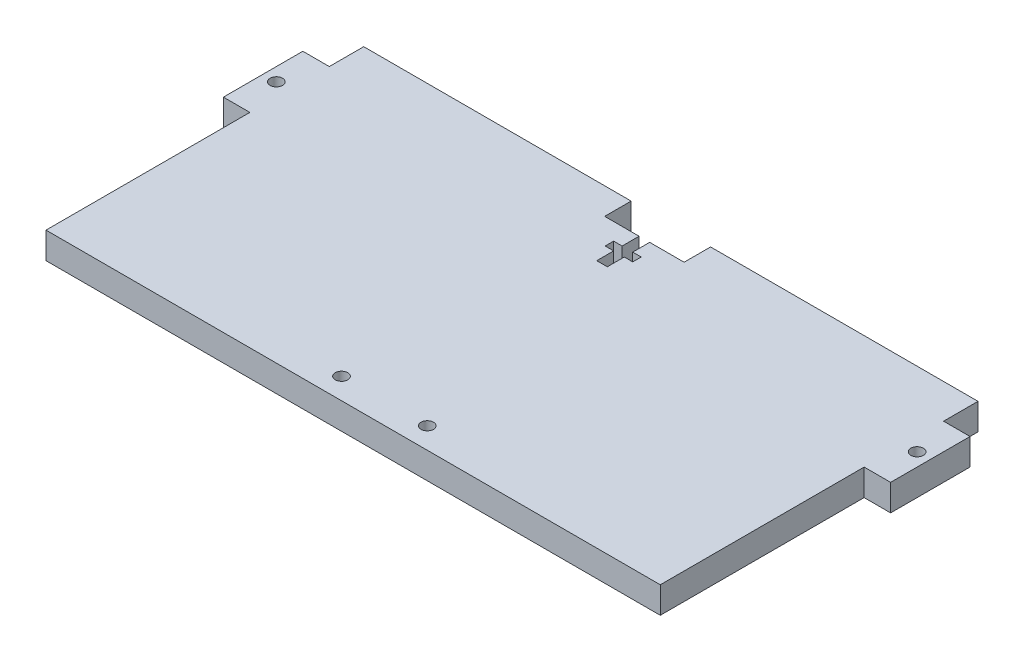
ISO-10303-21;
HEADER;
FILE_DESCRIPTION(('STEP AP214'),'2;1');
FILE_NAME('part.step','',(''),(''),'','','');
FILE_SCHEMA(('AUTOMOTIVE_DESIGN { 1 0 10303 214 1 1 1 1 }'));
ENDSEC;
DATA;
#1=APPLICATION_CONTEXT('core data for automotive mechanical design processes');
#2=APPLICATION_PROTOCOL_DEFINITION('international standard','automotive_design',2000,#1);
#3=PRODUCT_CONTEXT('',#1,'mechanical');
#4=PRODUCT('Part','Part','',(#3));
#5=PRODUCT_RELATED_PRODUCT_CATEGORY('part','',(#4));
#6=PRODUCT_DEFINITION_FORMATION('','',#4);
#7=PRODUCT_DEFINITION_CONTEXT('part definition',#1,'design');
#8=PRODUCT_DEFINITION('design','',#6,#7);
#9=PRODUCT_DEFINITION_SHAPE('','',#8);
#10=(LENGTH_UNIT() NAMED_UNIT(*) SI_UNIT(.MILLI.,.METRE.));
#11=(NAMED_UNIT(*) PLANE_ANGLE_UNIT() SI_UNIT($,.RADIAN.));
#12=(NAMED_UNIT(*) SI_UNIT($,.STERADIAN.) SOLID_ANGLE_UNIT());
#13=UNCERTAINTY_MEASURE_WITH_UNIT(LENGTH_MEASURE(1.E-05),#10,'distance_accuracy_value','');
#14=(GEOMETRIC_REPRESENTATION_CONTEXT(3) GLOBAL_UNCERTAINTY_ASSIGNED_CONTEXT((#13)) GLOBAL_UNIT_ASSIGNED_CONTEXT((#10,
#11,#12)) REPRESENTATION_CONTEXT('',''));
#15=CARTESIAN_POINT('',(0.,0.,0.));
#16=DIRECTION('',(0.,0.,1.));
#17=DIRECTION('',(1.,0.,0.));
#18=AXIS2_PLACEMENT_3D('',#15,#16,#17);
#19=CARTESIAN_POINT('',(-9.52499999999999,6.35,-34.925));
#20=DIRECTION('',(0.,0.,1.));
#21=DIRECTION('',(1.,0.,0.));
#22=AXIS2_PLACEMENT_3D('',#19,#20,#21);
#23=PLANE('',#22);
#24=DIRECTION('',(-1.,0.,0.));
#25=VECTOR('',#24,1.);
#26=CARTESIAN_POINT('',(-9.52499999999999,6.35,-34.925));
#27=LINE('',#26,#25);
#28=CARTESIAN_POINT('',(-1.27,6.35,-34.925));
#29=VERTEX_POINT('',#28);
#30=CARTESIAN_POINT('',(-9.52499999999999,6.35,-34.925));
#31=VERTEX_POINT('',#30);
#32=EDGE_CURVE('E455',#29,#31,#27,.T.);
#33=ORIENTED_EDGE('',*,*,#32,.F.);
#34=DIRECTION('',(0.,1.,0.));
#35=VECTOR('',#34,1.);
#36=CARTESIAN_POINT('',(-1.27,0.,-34.925));
#37=LINE('',#36,#35);
#38=CARTESIAN_POINT('',(-1.27,0.,-34.925));
#39=VERTEX_POINT('',#38);
#40=EDGE_CURVE('E329',#39,#29,#37,.T.);
#41=ORIENTED_EDGE('',*,*,#40,.F.);
#42=DIRECTION('',(-1.,0.,0.));
#43=VECTOR('',#42,1.);
#44=CARTESIAN_POINT('',(-9.52499999999999,0.,-34.925));
#45=LINE('',#44,#43);
#46=CARTESIAN_POINT('',(-9.52499999999999,0.,-34.925));
#47=VERTEX_POINT('',#46);
#48=EDGE_CURVE('E201',#39,#47,#45,.T.);
#49=ORIENTED_EDGE('',*,*,#48,.T.);
#50=DIRECTION('',(0.,-1.,0.));
#51=VECTOR('',#50,1.);
#52=CARTESIAN_POINT('',(-9.52499999999999,6.35,-34.925));
#53=LINE('',#52,#51);
#54=EDGE_CURVE('E257',#31,#47,#53,.T.);
#55=ORIENTED_EDGE('',*,*,#54,.F.);
#56=EDGE_LOOP('',(#33,#41,#49,#55));
#57=FACE_BOUND('',#56,.T.);
#58=ADVANCED_FACE('F33',(#57),#23,.F.);
#59=CARTESIAN_POINT('',(0.,6.35,0.));
#60=DIRECTION('',(0.,-1.,0.));
#61=DIRECTION('',(0.,0.,-1.));
#62=AXIS2_PLACEMENT_3D('',#59,#60,#61);
#63=PLANE('',#62);
#64=CARTESIAN_POINT('',(-7.87399999999999,6.35,29.845));
#65=DIRECTION('',(0.,1.,0.));
#66=DIRECTION('',(0.,0.,1.));
#67=AXIS2_PLACEMENT_3D('',#64,#65,#66);
#68=CIRCLE('',#67,1.5);
#69=CARTESIAN_POINT('',(-7.87399999999999,6.35,31.345));
#70=VERTEX_POINT('',#69);
#71=EDGE_CURVE('E430',#70,#70,#68,.T.);
#72=ORIENTED_EDGE('',*,*,#71,.F.);
#73=EDGE_LOOP('',(#72));
#74=FACE_BOUND('',#73,.T.);
#75=CARTESIAN_POINT('',(12.7,6.35,29.845));
#76=DIRECTION('',(0.,1.,0.));
#77=DIRECTION('',(0.,0.,1.));
#78=AXIS2_PLACEMENT_3D('',#75,#76,#77);
#79=CIRCLE('',#78,1.5);
#80=CARTESIAN_POINT('',(12.7,6.35,31.345));
#81=VERTEX_POINT('',#80);
#82=EDGE_CURVE('E433',#81,#81,#79,.T.);
#83=ORIENTED_EDGE('',*,*,#82,.F.);
#84=EDGE_LOOP('',(#83));
#85=FACE_BOUND('',#84,.T.);
#86=CARTESIAN_POINT('',(-76.835,6.35,-23.495));
#87=DIRECTION('',(0.,1.,0.));
#88=DIRECTION('',(0.,0.,1.));
#89=AXIS2_PLACEMENT_3D('',#86,#87,#88);
#90=CIRCLE('',#89,1.5);
#91=CARTESIAN_POINT('',(-76.835,6.35,-21.995));
#92=VERTEX_POINT('',#91);
#93=EDGE_CURVE('E199',#92,#92,#90,.T.);
#94=ORIENTED_EDGE('',*,*,#93,.F.);
#95=EDGE_LOOP('',(#94));
#96=FACE_BOUND('',#95,.T.);
#97=DIRECTION('',(-1.,0.,0.));
#98=VECTOR('',#97,1.);
#99=CARTESIAN_POINT('',(-1.27,6.35,-30.861));
#100=LINE('',#99,#98);
#101=CARTESIAN_POINT('',(-1.27,6.35,-30.861));
#102=VERTEX_POINT('',#101);
#103=CARTESIAN_POINT('',(-3.30199999999999,6.35,-30.861));
#104=VERTEX_POINT('',#103);
#105=EDGE_CURVE('E386',#102,#104,#100,.T.);
#106=ORIENTED_EDGE('',*,*,#105,.F.);
#107=DIRECTION('',(0.,0.,1.));
#108=VECTOR('',#107,1.);
#109=CARTESIAN_POINT('',(-1.27,6.35,-34.925));
#110=LINE('',#109,#108);
#111=EDGE_CURVE('E384',#29,#102,#110,.T.);
#112=ORIENTED_EDGE('',*,*,#111,.F.);
#113=ORIENTED_EDGE('',*,*,#32,.T.);
#114=DIRECTION('',(0.,0.,-1.));
#115=VECTOR('',#114,1.);
#116=CARTESIAN_POINT('',(-9.52499999999999,6.35,-34.925));
#117=LINE('',#116,#115);
#118=CARTESIAN_POINT('',(-9.52499999999999,6.35,-41.275));
#119=VERTEX_POINT('',#118);
#120=EDGE_CURVE('E458',#31,#119,#117,.T.);
#121=ORIENTED_EDGE('',*,*,#120,.T.);
#122=DIRECTION('',(-1.,0.,0.));
#123=VECTOR('',#122,1.);
#124=CARTESIAN_POINT('',(-9.52499999999999,6.35,-41.275));
#125=LINE('',#124,#123);
#126=CARTESIAN_POINT('',(-73.66,6.35,-41.275));
#127=VERTEX_POINT('',#126);
#128=EDGE_CURVE('E460',#119,#127,#125,.T.);
#129=ORIENTED_EDGE('',*,*,#128,.T.);
#130=DIRECTION('',(0.,0.,1.));
#131=VECTOR('',#130,1.);
#132=CARTESIAN_POINT('',(-73.66,6.35,-34.925));
#133=LINE('',#132,#131);
#134=CARTESIAN_POINT('',(-73.66,6.35,-33.02));
#135=VERTEX_POINT('',#134);
#136=EDGE_CURVE('E462',#127,#135,#133,.T.);
#137=ORIENTED_EDGE('',*,*,#136,.T.);
#138=DIRECTION('',(-1.,0.,0.));
#139=VECTOR('',#138,1.);
#140=CARTESIAN_POINT('',(-80.01,6.35,-33.02));
#141=LINE('',#140,#139);
#142=CARTESIAN_POINT('',(-80.01,6.35,-33.02));
#143=VERTEX_POINT('',#142);
#144=EDGE_CURVE('E464',#135,#143,#141,.T.);
#145=ORIENTED_EDGE('',*,*,#144,.T.);
#146=DIRECTION('',(0.,0.,1.));
#147=VECTOR('',#146,1.);
#148=CARTESIAN_POINT('',(-80.01,6.35,-13.97));
#149=LINE('',#148,#147);
#150=CARTESIAN_POINT('',(-80.01,6.35,-13.97));
#151=VERTEX_POINT('',#150);
#152=EDGE_CURVE('E466',#143,#151,#149,.T.);
#153=ORIENTED_EDGE('',*,*,#152,.T.);
#154=DIRECTION('',(1.,0.,0.));
#155=VECTOR('',#154,1.);
#156=CARTESIAN_POINT('',(-80.01,6.35,-13.97));
#157=LINE('',#156,#155);
#158=CARTESIAN_POINT('',(-73.66,6.35,-13.97));
#159=VERTEX_POINT('',#158);
#160=EDGE_CURVE('E468',#151,#159,#157,.T.);
#161=ORIENTED_EDGE('',*,*,#160,.T.);
#162=DIRECTION('',(0.,0.,1.));
#163=VECTOR('',#162,1.);
#164=CARTESIAN_POINT('',(-73.66,6.35,34.925));
#165=LINE('',#164,#163);
#166=CARTESIAN_POINT('',(-73.66,6.35,34.925));
#167=VERTEX_POINT('',#166);
#168=EDGE_CURVE('E470',#159,#167,#165,.T.);
#169=ORIENTED_EDGE('',*,*,#168,.T.);
#170=DIRECTION('',(1.,0.,0.));
#171=VECTOR('',#170,1.);
#172=CARTESIAN_POINT('',(-73.66,6.35,34.925));
#173=LINE('',#172,#171);
#174=CARTESIAN_POINT('',(73.66,6.35,34.925));
#175=VERTEX_POINT('',#174);
#176=EDGE_CURVE('E472',#167,#175,#173,.T.);
#177=ORIENTED_EDGE('',*,*,#176,.T.);
#178=DIRECTION('',(0.,0.,-1.));
#179=VECTOR('',#178,1.);
#180=CARTESIAN_POINT('',(73.66,6.35,34.925));
#181=LINE('',#180,#179);
#182=CARTESIAN_POINT('',(73.66,6.35,-13.97));
#183=VERTEX_POINT('',#182);
#184=EDGE_CURVE('E173',#175,#183,#181,.T.);
#185=ORIENTED_EDGE('',*,*,#184,.T.);
#186=DIRECTION('',(1.,0.,0.));
#187=VECTOR('',#186,1.);
#188=CARTESIAN_POINT('',(80.01,6.35,-13.97));
#189=LINE('',#188,#187);
#190=CARTESIAN_POINT('',(80.01,6.35,-13.97));
#191=VERTEX_POINT('',#190);
#192=EDGE_CURVE('E164',#183,#191,#189,.T.);
#193=ORIENTED_EDGE('',*,*,#192,.T.);
#194=DIRECTION('',(0.,0.,-1.));
#195=VECTOR('',#194,1.);
#196=CARTESIAN_POINT('',(80.01,6.35,-13.97));
#197=LINE('',#196,#195);
#198=CARTESIAN_POINT('',(80.01,6.35,-33.02));
#199=VERTEX_POINT('',#198);
#200=EDGE_CURVE('E170',#191,#199,#197,.T.);
#201=ORIENTED_EDGE('',*,*,#200,.T.);
#202=DIRECTION('',(-1.,0.,0.));
#203=VECTOR('',#202,1.);
#204=CARTESIAN_POINT('',(80.01,6.35,-33.02));
#205=LINE('',#204,#203);
#206=CARTESIAN_POINT('',(73.66,6.35,-33.02));
#207=VERTEX_POINT('',#206);
#208=EDGE_CURVE('E190',#199,#207,#205,.T.);
#209=ORIENTED_EDGE('',*,*,#208,.T.);
#210=DIRECTION('',(0.,0.,-1.));
#211=VECTOR('',#210,1.);
#212=CARTESIAN_POINT('',(73.66,6.35,-41.275));
#213=LINE('',#212,#211);
#214=CARTESIAN_POINT('',(73.66,6.35,-41.275));
#215=VERTEX_POINT('',#214);
#216=EDGE_CURVE('E57',#207,#215,#213,.T.);
#217=ORIENTED_EDGE('',*,*,#216,.T.);
#218=DIRECTION('',(-1.,0.,0.));
#219=VECTOR('',#218,1.);
#220=CARTESIAN_POINT('',(9.52500000000001,6.35,-41.275));
#221=LINE('',#220,#219);
#222=CARTESIAN_POINT('',(9.52500000000001,6.35,-41.275));
#223=VERTEX_POINT('',#222);
#224=EDGE_CURVE('E123',#215,#223,#221,.T.);
#225=ORIENTED_EDGE('',*,*,#224,.T.);
#226=DIRECTION('',(0.,0.,1.));
#227=VECTOR('',#226,1.);
#228=CARTESIAN_POINT('',(9.52500000000001,6.35,-41.275));
#229=LINE('',#228,#227);
#230=CARTESIAN_POINT('',(9.52500000000001,6.35,-34.925));
#231=VERTEX_POINT('',#230);
#232=EDGE_CURVE('E268',#223,#231,#229,.T.);
#233=ORIENTED_EDGE('',*,*,#232,.T.);
#234=CARTESIAN_POINT('',(1.27,6.35,-34.925));
#235=VERTEX_POINT('',#234);
#236=EDGE_CURVE('E456',#231,#235,#27,.T.);
#237=ORIENTED_EDGE('',*,*,#236,.T.);
#238=DIRECTION('',(0.,0.,-1.));
#239=VECTOR('',#238,1.);
#240=CARTESIAN_POINT('',(1.27,6.35,-34.925));
#241=LINE('',#240,#239);
#242=CARTESIAN_POINT('',(1.27,6.35,-30.861));
#243=VERTEX_POINT('',#242);
#244=EDGE_CURVE('E48',#243,#235,#241,.T.);
#245=ORIENTED_EDGE('',*,*,#244,.F.);
#246=DIRECTION('',(-1.,0.,0.));
#247=VECTOR('',#246,1.);
#248=CARTESIAN_POINT('',(1.27,6.35,-30.861));
#249=LINE('',#248,#247);
#250=CARTESIAN_POINT('',(3.30199999999999,6.35,-30.861));
#251=VERTEX_POINT('',#250);
#252=EDGE_CURVE('E408',#251,#243,#249,.T.);
#253=ORIENTED_EDGE('',*,*,#252,.F.);
#254=DIRECTION('',(0.,0.,-1.));
#255=VECTOR('',#254,1.);
#256=CARTESIAN_POINT('',(3.30199999999999,6.35,-30.861));
#257=LINE('',#256,#255);
#258=CARTESIAN_POINT('',(3.30199999999999,6.35,-28.829));
#259=VERTEX_POINT('',#258);
#260=EDGE_CURVE('E367',#259,#251,#257,.T.);
#261=ORIENTED_EDGE('',*,*,#260,.F.);
#262=DIRECTION('',(1.,0.,0.));
#263=VECTOR('',#262,1.);
#264=CARTESIAN_POINT('',(1.27,6.35,-28.829));
#265=LINE('',#264,#263);
#266=CARTESIAN_POINT('',(1.27,6.35,-28.829));
#267=VERTEX_POINT('',#266);
#268=EDGE_CURVE('E404',#267,#259,#265,.T.);
#269=ORIENTED_EDGE('',*,*,#268,.F.);
#270=DIRECTION('',(0.,0.,-1.));
#271=VECTOR('',#270,1.);
#272=CARTESIAN_POINT('',(1.27,6.35,-28.829));
#273=LINE('',#272,#271);
#274=CARTESIAN_POINT('',(1.27,6.35,-24.765));
#275=VERTEX_POINT('',#274);
#276=EDGE_CURVE('E401',#275,#267,#273,.T.);
#277=ORIENTED_EDGE('',*,*,#276,.F.);
#278=DIRECTION('',(1.,0.,0.));
#279=VECTOR('',#278,1.);
#280=CARTESIAN_POINT('',(-1.27,6.35,-24.765));
#281=LINE('',#280,#279);
#282=CARTESIAN_POINT('',(-1.27,6.35,-24.765));
#283=VERTEX_POINT('',#282);
#284=EDGE_CURVE('E398',#283,#275,#281,.T.);
#285=ORIENTED_EDGE('',*,*,#284,.F.);
#286=DIRECTION('',(0.,0.,1.));
#287=VECTOR('',#286,1.);
#288=CARTESIAN_POINT('',(-1.27,6.35,-28.829));
#289=LINE('',#288,#287);
#290=CARTESIAN_POINT('',(-1.27,6.35,-28.829));
#291=VERTEX_POINT('',#290);
#292=EDGE_CURVE('E395',#291,#283,#289,.T.);
#293=ORIENTED_EDGE('',*,*,#292,.F.);
#294=DIRECTION('',(1.,0.,0.));
#295=VECTOR('',#294,1.);
#296=CARTESIAN_POINT('',(-1.27,6.35,-28.829));
#297=LINE('',#296,#295);
#298=CARTESIAN_POINT('',(-3.30199999999999,6.35,-28.829));
#299=VERTEX_POINT('',#298);
#300=EDGE_CURVE('E392',#299,#291,#297,.T.);
#301=ORIENTED_EDGE('',*,*,#300,.F.);
#302=DIRECTION('',(0.,0.,1.));
#303=VECTOR('',#302,1.);
#304=CARTESIAN_POINT('',(-3.30199999999999,6.35,-30.861));
#305=LINE('',#304,#303);
#306=EDGE_CURVE('E389',#104,#299,#305,.T.);
#307=ORIENTED_EDGE('',*,*,#306,.F.);
#308=EDGE_LOOP('',(#106,#112,#113,#121,#129,#137,#145,#153,#161,#169,#177,#185,#193,#201,#209,
#217,#225,#233,#237,#245,#253,#261,#269,#277,#285,#293,#301,#307));
#309=FACE_BOUND('',#308,.T.);
#310=CARTESIAN_POINT('',(76.835,6.35,-23.495));
#311=DIRECTION('',(0.,1.,0.));
#312=DIRECTION('',(0.,0.,-1.));
#313=AXIS2_PLACEMENT_3D('',#310,#311,#312);
#314=CIRCLE('',#313,1.5);
#315=CARTESIAN_POINT('',(76.835,6.35,-24.995));
#316=VERTEX_POINT('',#315);
#317=EDGE_CURVE('E442',#316,#316,#314,.T.);
#318=ORIENTED_EDGE('',*,*,#317,.F.);
#319=EDGE_LOOP('',(#318));
#320=FACE_BOUND('',#319,.T.);
#321=ADVANCED_FACE('F167',(#74,#85,#96,#309,#320),#63,.F.);
#322=CARTESIAN_POINT('',(0.,0.,0.));
#323=DIRECTION('',(0.,-1.,0.));
#324=DIRECTION('',(0.,0.,-1.));
#325=AXIS2_PLACEMENT_3D('',#322,#323,#324);
#326=PLANE('',#325);
#327=DIRECTION('',(0.,0.,1.));
#328=VECTOR('',#327,1.);
#329=CARTESIAN_POINT('',(-1.27,0.,-34.925));
#330=LINE('',#329,#328);
#331=CARTESIAN_POINT('',(-1.27,0.,-30.861));
#332=VERTEX_POINT('',#331);
#333=EDGE_CURVE('E411',#39,#332,#330,.T.);
#334=ORIENTED_EDGE('',*,*,#333,.T.);
#335=DIRECTION('',(-1.,0.,0.));
#336=VECTOR('',#335,1.);
#337=CARTESIAN_POINT('',(-1.27,0.,-30.861));
#338=LINE('',#337,#336);
#339=CARTESIAN_POINT('',(-3.30199999999999,0.,-30.861));
#340=VERTEX_POINT('',#339);
#341=EDGE_CURVE('E840',#332,#340,#338,.T.);
#342=ORIENTED_EDGE('',*,*,#341,.T.);
#343=DIRECTION('',(0.,0.,1.));
#344=VECTOR('',#343,1.);
#345=CARTESIAN_POINT('',(-3.30199999999999,0.,-30.861));
#346=LINE('',#345,#344);
#347=CARTESIAN_POINT('',(-3.30199999999999,0.,-28.829));
#348=VERTEX_POINT('',#347);
#349=EDGE_CURVE('E818',#340,#348,#346,.T.);
#350=ORIENTED_EDGE('',*,*,#349,.T.);
#351=DIRECTION('',(1.,0.,0.));
#352=VECTOR('',#351,1.);
#353=CARTESIAN_POINT('',(-1.27,0.,-28.829));
#354=LINE('',#353,#352);
#355=CARTESIAN_POINT('',(-1.27,0.,-28.829));
#356=VERTEX_POINT('',#355);
#357=EDGE_CURVE('E815',#348,#356,#354,.T.);
#358=ORIENTED_EDGE('',*,*,#357,.T.);
#359=DIRECTION('',(0.,0.,1.));
#360=VECTOR('',#359,1.);
#361=CARTESIAN_POINT('',(-1.27,0.,-28.829));
#362=LINE('',#361,#360);
#363=CARTESIAN_POINT('',(-1.27,0.,-24.765));
#364=VERTEX_POINT('',#363);
#365=EDGE_CURVE('E846',#356,#364,#362,.T.);
#366=ORIENTED_EDGE('',*,*,#365,.T.);
#367=DIRECTION('',(1.,0.,0.));
#368=VECTOR('',#367,1.);
#369=CARTESIAN_POINT('',(-1.27,0.,-24.765));
#370=LINE('',#369,#368);
#371=CARTESIAN_POINT('',(1.27,0.,-24.765));
#372=VERTEX_POINT('',#371);
#373=EDGE_CURVE('E808',#364,#372,#370,.T.);
#374=ORIENTED_EDGE('',*,*,#373,.T.);
#375=DIRECTION('',(0.,0.,-1.));
#376=VECTOR('',#375,1.);
#377=CARTESIAN_POINT('',(1.27,0.,-28.829));
#378=LINE('',#377,#376);
#379=CARTESIAN_POINT('',(1.27,0.,-28.829));
#380=VERTEX_POINT('',#379);
#381=EDGE_CURVE('E379',#372,#380,#378,.T.);
#382=ORIENTED_EDGE('',*,*,#381,.T.);
#383=DIRECTION('',(1.,0.,0.));
#384=VECTOR('',#383,1.);
#385=CARTESIAN_POINT('',(1.27,0.,-28.829));
#386=LINE('',#385,#384);
#387=CARTESIAN_POINT('',(3.30199999999999,0.,-28.829));
#388=VERTEX_POINT('',#387);
#389=EDGE_CURVE('E377',#380,#388,#386,.T.);
#390=ORIENTED_EDGE('',*,*,#389,.T.);
#391=DIRECTION('',(0.,0.,-1.));
#392=VECTOR('',#391,1.);
#393=CARTESIAN_POINT('',(3.30199999999999,0.,-30.861));
#394=LINE('',#393,#392);
#395=CARTESIAN_POINT('',(3.30199999999999,0.,-30.861));
#396=VERTEX_POINT('',#395);
#397=EDGE_CURVE('E364',#388,#396,#394,.T.);
#398=ORIENTED_EDGE('',*,*,#397,.T.);
#399=DIRECTION('',(-1.,0.,0.));
#400=VECTOR('',#399,1.);
#401=CARTESIAN_POINT('',(1.27,0.,-30.861));
#402=LINE('',#401,#400);
#403=CARTESIAN_POINT('',(1.27,0.,-30.861));
#404=VERTEX_POINT('',#403);
#405=EDGE_CURVE('E372',#396,#404,#402,.T.);
#406=ORIENTED_EDGE('',*,*,#405,.T.);
#407=DIRECTION('',(0.,0.,-1.));
#408=VECTOR('',#407,1.);
#409=CARTESIAN_POINT('',(1.27,0.,-34.925));
#410=LINE('',#409,#408);
#411=CARTESIAN_POINT('',(1.27,0.,-34.925));
#412=VERTEX_POINT('',#411);
#413=EDGE_CURVE('E280',#404,#412,#410,.T.);
#414=ORIENTED_EDGE('',*,*,#413,.T.);
#415=CARTESIAN_POINT('',(9.52500000000001,0.,-34.925));
#416=VERTEX_POINT('',#415);
#417=EDGE_CURVE('E202',#416,#412,#45,.T.);
#418=ORIENTED_EDGE('',*,*,#417,.F.);
#419=DIRECTION('',(0.,0.,1.));
#420=VECTOR('',#419,1.);
#421=CARTESIAN_POINT('',(9.52500000000001,0.,-41.275));
#422=LINE('',#421,#420);
#423=CARTESIAN_POINT('',(9.52500000000001,0.,-41.275));
#424=VERTEX_POINT('',#423);
#425=EDGE_CURVE('E198',#424,#416,#422,.T.);
#426=ORIENTED_EDGE('',*,*,#425,.F.);
#427=DIRECTION('',(-1.,0.,0.));
#428=VECTOR('',#427,1.);
#429=CARTESIAN_POINT('',(9.52500000000001,0.,-41.275));
#430=LINE('',#429,#428);
#431=CARTESIAN_POINT('',(73.66,0.,-41.275));
#432=VERTEX_POINT('',#431);
#433=EDGE_CURVE('E196',#432,#424,#430,.T.);
#434=ORIENTED_EDGE('',*,*,#433,.F.);
#435=DIRECTION('',(0.,0.,-1.));
#436=VECTOR('',#435,1.);
#437=CARTESIAN_POINT('',(73.66,0.,-33.02));
#438=LINE('',#437,#436);
#439=CARTESIAN_POINT('',(73.66,0.,-33.02));
#440=VERTEX_POINT('',#439);
#441=EDGE_CURVE('E228',#440,#432,#438,.T.);
#442=ORIENTED_EDGE('',*,*,#441,.F.);
#443=DIRECTION('',(-1.,0.,0.));
#444=VECTOR('',#443,1.);
#445=CARTESIAN_POINT('',(80.01,0.,-33.02));
#446=LINE('',#445,#444);
#447=CARTESIAN_POINT('',(80.01,0.,-33.02));
#448=VERTEX_POINT('',#447);
#449=EDGE_CURVE('E116',#448,#440,#446,.T.);
#450=ORIENTED_EDGE('',*,*,#449,.F.);
#451=DIRECTION('',(0.,0.,-1.));
#452=VECTOR('',#451,1.);
#453=CARTESIAN_POINT('',(80.01,0.,-13.97));
#454=LINE('',#453,#452);
#455=CARTESIAN_POINT('',(80.01,0.,-13.97));
#456=VERTEX_POINT('',#455);
#457=EDGE_CURVE('E225',#456,#448,#454,.T.);
#458=ORIENTED_EDGE('',*,*,#457,.F.);
#459=DIRECTION('',(1.,0.,0.));
#460=VECTOR('',#459,1.);
#461=CARTESIAN_POINT('',(80.01,0.,-13.97));
#462=LINE('',#461,#460);
#463=CARTESIAN_POINT('',(73.66,0.,-13.97));
#464=VERTEX_POINT('',#463);
#465=EDGE_CURVE('E182',#464,#456,#462,.T.);
#466=ORIENTED_EDGE('',*,*,#465,.F.);
#467=DIRECTION('',(0.,0.,-1.));
#468=VECTOR('',#467,1.);
#469=CARTESIAN_POINT('',(73.66,0.,34.925));
#470=LINE('',#469,#468);
#471=CARTESIAN_POINT('',(73.66,0.,34.925));
#472=VERTEX_POINT('',#471);
#473=EDGE_CURVE('E222',#472,#464,#470,.T.);
#474=ORIENTED_EDGE('',*,*,#473,.F.);
#475=DIRECTION('',(1.,0.,0.));
#476=VECTOR('',#475,1.);
#477=CARTESIAN_POINT('',(-73.66,0.,34.925));
#478=LINE('',#477,#476);
#479=CARTESIAN_POINT('',(-73.66,0.,34.925));
#480=VERTEX_POINT('',#479);
#481=EDGE_CURVE('E220',#480,#472,#478,.T.);
#482=ORIENTED_EDGE('',*,*,#481,.F.);
#483=DIRECTION('',(0.,0.,1.));
#484=VECTOR('',#483,1.);
#485=CARTESIAN_POINT('',(-73.66,0.,34.925));
#486=LINE('',#485,#484);
#487=CARTESIAN_POINT('',(-73.66,0.,-13.97));
#488=VERTEX_POINT('',#487);
#489=EDGE_CURVE('E218',#488,#480,#486,.T.);
#490=ORIENTED_EDGE('',*,*,#489,.F.);
#491=DIRECTION('',(1.,0.,0.));
#492=VECTOR('',#491,1.);
#493=CARTESIAN_POINT('',(-80.01,0.,-13.97));
#494=LINE('',#493,#492);
#495=CARTESIAN_POINT('',(-80.01,0.,-13.97));
#496=VERTEX_POINT('',#495);
#497=EDGE_CURVE('E216',#496,#488,#494,.T.);
#498=ORIENTED_EDGE('',*,*,#497,.F.);
#499=DIRECTION('',(0.,0.,1.));
#500=VECTOR('',#499,1.);
#501=CARTESIAN_POINT('',(-80.01,0.,-13.97));
#502=LINE('',#501,#500);
#503=CARTESIAN_POINT('',(-80.01,0.,-33.02));
#504=VERTEX_POINT('',#503);
#505=EDGE_CURVE('E214',#504,#496,#502,.T.);
#506=ORIENTED_EDGE('',*,*,#505,.F.);
#507=DIRECTION('',(-1.,0.,0.));
#508=VECTOR('',#507,1.);
#509=CARTESIAN_POINT('',(-80.01,0.,-33.02));
#510=LINE('',#509,#508);
#511=CARTESIAN_POINT('',(-73.66,0.,-33.02));
#512=VERTEX_POINT('',#511);
#513=EDGE_CURVE('E212',#512,#504,#510,.T.);
#514=ORIENTED_EDGE('',*,*,#513,.F.);
#515=DIRECTION('',(0.,0.,1.));
#516=VECTOR('',#515,1.);
#517=CARTESIAN_POINT('',(-73.66,0.,-33.02));
#518=LINE('',#517,#516);
#519=CARTESIAN_POINT('',(-73.66,0.,-41.275));
#520=VERTEX_POINT('',#519);
#521=EDGE_CURVE('E210',#520,#512,#518,.T.);
#522=ORIENTED_EDGE('',*,*,#521,.F.);
#523=DIRECTION('',(-1.,0.,0.));
#524=VECTOR('',#523,1.);
#525=CARTESIAN_POINT('',(-9.52499999999999,0.,-41.275));
#526=LINE('',#525,#524);
#527=CARTESIAN_POINT('',(-9.52499999999999,0.,-41.275));
#528=VERTEX_POINT('',#527);
#529=EDGE_CURVE('E207',#528,#520,#526,.T.);
#530=ORIENTED_EDGE('',*,*,#529,.F.);
#531=DIRECTION('',(0.,0.,-1.));
#532=VECTOR('',#531,1.);
#533=CARTESIAN_POINT('',(-9.52499999999999,0.,-34.925));
#534=LINE('',#533,#532);
#535=EDGE_CURVE('E205',#47,#528,#534,.T.);
#536=ORIENTED_EDGE('',*,*,#535,.F.);
#537=ORIENTED_EDGE('',*,*,#48,.F.);
#538=EDGE_LOOP('',(#334,#342,#350,#358,#366,#374,#382,#390,#398,#406,#414,#418,#426,#434,#442,
#450,#458,#466,#474,#482,#490,#498,#506,#514,#522,#530,#536,#537));
#539=FACE_BOUND('',#538,.T.);
#540=CARTESIAN_POINT('',(-7.87399999999999,0.,29.845));
#541=DIRECTION('',(0.,1.,0.));
#542=DIRECTION('',(0.,0.,1.));
#543=AXIS2_PLACEMENT_3D('',#540,#541,#542);
#544=CIRCLE('',#543,1.5);
#545=CARTESIAN_POINT('',(-7.87399999999999,0.,31.345));
#546=VERTEX_POINT('',#545);
#547=EDGE_CURVE('E413',#546,#546,#544,.T.);
#548=ORIENTED_EDGE('',*,*,#547,.T.);
#549=EDGE_LOOP('',(#548));
#550=FACE_BOUND('',#549,.T.);
#551=CARTESIAN_POINT('',(12.7,0.,29.845));
#552=DIRECTION('',(0.,1.,0.));
#553=DIRECTION('',(0.,0.,1.));
#554=AXIS2_PLACEMENT_3D('',#551,#552,#553);
#555=CIRCLE('',#554,1.5);
#556=CARTESIAN_POINT('',(12.7,0.,31.345));
#557=VERTEX_POINT('',#556);
#558=EDGE_CURVE('E436',#557,#557,#555,.T.);
#559=ORIENTED_EDGE('',*,*,#558,.T.);
#560=EDGE_LOOP('',(#559));
#561=FACE_BOUND('',#560,.T.);
#562=CARTESIAN_POINT('',(-76.835,0.,-23.495));
#563=DIRECTION('',(0.,1.,0.));
#564=DIRECTION('',(0.,0.,1.));
#565=AXIS2_PLACEMENT_3D('',#562,#563,#564);
#566=CIRCLE('',#565,1.5);
#567=CARTESIAN_POINT('',(-76.835,0.,-21.995));
#568=VERTEX_POINT('',#567);
#569=EDGE_CURVE('E445',#568,#568,#566,.T.);
#570=ORIENTED_EDGE('',*,*,#569,.T.);
#571=EDGE_LOOP('',(#570));
#572=FACE_BOUND('',#571,.T.);
#573=CARTESIAN_POINT('',(76.835,0.,-23.495));
#574=DIRECTION('',(0.,1.,0.));
#575=DIRECTION('',(0.,0.,-1.));
#576=AXIS2_PLACEMENT_3D('',#573,#574,#575);
#577=CIRCLE('',#576,1.5);
#578=CARTESIAN_POINT('',(76.835,0.,-24.995));
#579=VERTEX_POINT('',#578);
#580=EDGE_CURVE('E439',#579,#579,#577,.T.);
#581=ORIENTED_EDGE('',*,*,#580,.T.);
#582=EDGE_LOOP('',(#581));
#583=FACE_BOUND('',#582,.T.);
#584=ADVANCED_FACE('F273',(#539,#550,#561,#572,#583),#326,.T.);
#585=CARTESIAN_POINT('',(9.52500000000001,6.35,-41.275));
#586=DIRECTION('',(0.,0.,1.));
#587=DIRECTION('',(1.,0.,0.));
#588=AXIS2_PLACEMENT_3D('',#585,#586,#587);
#589=PLANE('',#588);
#590=ORIENTED_EDGE('',*,*,#433,.T.);
#591=DIRECTION('',(0.,-1.,0.));
#592=VECTOR('',#591,1.);
#593=CARTESIAN_POINT('',(9.52500000000001,6.35,-41.275));
#594=LINE('',#593,#592);
#595=EDGE_CURVE('E41',#223,#424,#594,.T.);
#596=ORIENTED_EDGE('',*,*,#595,.F.);
#597=ORIENTED_EDGE('',*,*,#224,.F.);
#598=DIRECTION('',(0.,-1.,0.));
#599=VECTOR('',#598,1.);
#600=CARTESIAN_POINT('',(73.66,6.35,-41.275));
#601=LINE('',#600,#599);
#602=EDGE_CURVE('E11',#215,#432,#601,.T.);
#603=ORIENTED_EDGE('',*,*,#602,.T.);
#604=EDGE_LOOP('',(#590,#596,#597,#603));
#605=FACE_BOUND('',#604,.T.);
#606=ADVANCED_FACE('F35',(#605),#589,.F.);
#607=CARTESIAN_POINT('',(9.52500000000001,6.35,-41.275));
#608=DIRECTION('',(1.,0.,0.));
#609=DIRECTION('',(0.,0.,-1.));
#610=AXIS2_PLACEMENT_3D('',#607,#608,#609);
#611=PLANE('',#610);
#612=ORIENTED_EDGE('',*,*,#425,.T.);
#613=DIRECTION('',(0.,-1.,0.));
#614=VECTOR('',#613,1.);
#615=CARTESIAN_POINT('',(9.52500000000001,6.35,-34.925));
#616=LINE('',#615,#614);
#617=EDGE_CURVE('E260',#231,#416,#616,.T.);
#618=ORIENTED_EDGE('',*,*,#617,.F.);
#619=ORIENTED_EDGE('',*,*,#232,.F.);
#620=ORIENTED_EDGE('',*,*,#595,.T.);
#621=EDGE_LOOP('',(#612,#618,#619,#620));
#622=FACE_BOUND('',#621,.T.);
#623=ADVANCED_FACE('F266',(#622),#611,.F.);
#624=ORIENTED_EDGE('',*,*,#417,.T.);
#625=DIRECTION('',(0.,1.,0.));
#626=VECTOR('',#625,1.);
#627=CARTESIAN_POINT('',(1.27,0.,-34.925));
#628=LINE('',#627,#626);
#629=EDGE_CURVE('E284',#412,#235,#628,.T.);
#630=ORIENTED_EDGE('',*,*,#629,.T.);
#631=ORIENTED_EDGE('',*,*,#236,.F.);
#632=ORIENTED_EDGE('',*,*,#617,.T.);
#633=EDGE_LOOP('',(#624,#630,#631,#632));
#634=FACE_BOUND('',#633,.T.);
#635=ADVANCED_FACE('F282',(#634),#23,.F.);
#636=CARTESIAN_POINT('',(-9.52499999999999,6.35,-34.925));
#637=DIRECTION('',(-1.,0.,0.));
#638=DIRECTION('',(0.,0.,1.));
#639=AXIS2_PLACEMENT_3D('',#636,#637,#638);
#640=PLANE('',#639);
#641=ORIENTED_EDGE('',*,*,#535,.T.);
#642=DIRECTION('',(0.,-1.,0.));
#643=VECTOR('',#642,1.);
#644=CARTESIAN_POINT('',(-9.52499999999999,6.35,-41.275));
#645=LINE('',#644,#643);
#646=EDGE_CURVE('E254',#119,#528,#645,.T.);
#647=ORIENTED_EDGE('',*,*,#646,.F.);
#648=ORIENTED_EDGE('',*,*,#120,.F.);
#649=ORIENTED_EDGE('',*,*,#54,.T.);
#650=EDGE_LOOP('',(#641,#647,#648,#649));
#651=FACE_BOUND('',#650,.T.);
#652=ADVANCED_FACE('F504',(#651),#640,.F.);
#653=CARTESIAN_POINT('',(-9.52499999999999,6.35,-41.275));
#654=DIRECTION('',(0.,0.,1.));
#655=DIRECTION('',(1.,0.,0.));
#656=AXIS2_PLACEMENT_3D('',#653,#654,#655);
#657=PLANE('',#656);
#658=ORIENTED_EDGE('',*,*,#529,.T.);
#659=DIRECTION('',(0.,-1.,0.));
#660=VECTOR('',#659,1.);
#661=CARTESIAN_POINT('',(-73.66,6.35,-41.275));
#662=LINE('',#661,#660);
#663=EDGE_CURVE('E251',#127,#520,#662,.T.);
#664=ORIENTED_EDGE('',*,*,#663,.F.);
#665=ORIENTED_EDGE('',*,*,#128,.F.);
#666=ORIENTED_EDGE('',*,*,#646,.T.);
#667=EDGE_LOOP('',(#658,#664,#665,#666));
#668=FACE_BOUND('',#667,.T.);
#669=ADVANCED_FACE('F509',(#668),#657,.F.);
#670=CARTESIAN_POINT('',(-73.66,6.35,-33.02));
#671=DIRECTION('',(1.,0.,0.));
#672=DIRECTION('',(0.,0.,-1.));
#673=AXIS2_PLACEMENT_3D('',#670,#671,#672);
#674=PLANE('',#673);
#675=ORIENTED_EDGE('',*,*,#521,.T.);
#676=DIRECTION('',(0.,-1.,0.));
#677=VECTOR('',#676,1.);
#678=CARTESIAN_POINT('',(-73.66,6.35,-33.02));
#679=LINE('',#678,#677);
#680=EDGE_CURVE('E248',#135,#512,#679,.T.);
#681=ORIENTED_EDGE('',*,*,#680,.F.);
#682=ORIENTED_EDGE('',*,*,#136,.F.);
#683=ORIENTED_EDGE('',*,*,#663,.T.);
#684=EDGE_LOOP('',(#675,#681,#682,#683));
#685=FACE_BOUND('',#684,.T.);
#686=ADVANCED_FACE('F514',(#685),#674,.F.);
#687=CARTESIAN_POINT('',(-80.01,6.35,-33.02));
#688=DIRECTION('',(0.,0.,1.));
#689=DIRECTION('',(1.,0.,0.));
#690=AXIS2_PLACEMENT_3D('',#687,#688,#689);
#691=PLANE('',#690);
#692=ORIENTED_EDGE('',*,*,#513,.T.);
#693=DIRECTION('',(0.,-1.,0.));
#694=VECTOR('',#693,1.);
#695=CARTESIAN_POINT('',(-80.01,6.35,-33.02));
#696=LINE('',#695,#694);
#697=EDGE_CURVE('E245',#143,#504,#696,.T.);
#698=ORIENTED_EDGE('',*,*,#697,.F.);
#699=ORIENTED_EDGE('',*,*,#144,.F.);
#700=ORIENTED_EDGE('',*,*,#680,.T.);
#701=EDGE_LOOP('',(#692,#698,#699,#700));
#702=FACE_BOUND('',#701,.T.);
#703=ADVANCED_FACE('F520',(#702),#691,.F.);
#704=CARTESIAN_POINT('',(-80.01,6.35,-13.97));
#705=DIRECTION('',(1.,0.,0.));
#706=DIRECTION('',(0.,0.,-1.));
#707=AXIS2_PLACEMENT_3D('',#704,#705,#706);
#708=PLANE('',#707);
#709=ORIENTED_EDGE('',*,*,#505,.T.);
#710=DIRECTION('',(0.,-1.,0.));
#711=VECTOR('',#710,1.);
#712=CARTESIAN_POINT('',(-80.01,6.35,-13.97));
#713=LINE('',#712,#711);
#714=EDGE_CURVE('E242',#151,#496,#713,.T.);
#715=ORIENTED_EDGE('',*,*,#714,.F.);
#716=ORIENTED_EDGE('',*,*,#152,.F.);
#717=ORIENTED_EDGE('',*,*,#697,.T.);
#718=EDGE_LOOP('',(#709,#715,#716,#717));
#719=FACE_BOUND('',#718,.T.);
#720=ADVANCED_FACE('F524',(#719),#708,.F.);
#721=CARTESIAN_POINT('',(-80.01,6.35,-13.97));
#722=DIRECTION('',(0.,0.,-1.));
#723=DIRECTION('',(-1.,0.,0.));
#724=AXIS2_PLACEMENT_3D('',#721,#722,#723);
#725=PLANE('',#724);
#726=ORIENTED_EDGE('',*,*,#497,.T.);
#727=DIRECTION('',(0.,-1.,0.));
#728=VECTOR('',#727,1.);
#729=CARTESIAN_POINT('',(-73.66,6.35,-13.97));
#730=LINE('',#729,#728);
#731=EDGE_CURVE('E239',#159,#488,#730,.T.);
#732=ORIENTED_EDGE('',*,*,#731,.F.);
#733=ORIENTED_EDGE('',*,*,#160,.F.);
#734=ORIENTED_EDGE('',*,*,#714,.T.);
#735=EDGE_LOOP('',(#726,#732,#733,#734));
#736=FACE_BOUND('',#735,.T.);
#737=ADVANCED_FACE('F528',(#736),#725,.F.);
#738=CARTESIAN_POINT('',(-73.66,6.35,34.925));
#739=DIRECTION('',(1.,0.,0.));
#740=DIRECTION('',(0.,0.,-1.));
#741=AXIS2_PLACEMENT_3D('',#738,#739,#740);
#742=PLANE('',#741);
#743=ORIENTED_EDGE('',*,*,#489,.T.);
#744=DIRECTION('',(0.,-1.,0.));
#745=VECTOR('',#744,1.);
#746=CARTESIAN_POINT('',(-73.66,6.35,34.925));
#747=LINE('',#746,#745);
#748=EDGE_CURVE('E236',#167,#480,#747,.T.);
#749=ORIENTED_EDGE('',*,*,#748,.F.);
#750=ORIENTED_EDGE('',*,*,#168,.F.);
#751=ORIENTED_EDGE('',*,*,#731,.T.);
#752=EDGE_LOOP('',(#743,#749,#750,#751));
#753=FACE_BOUND('',#752,.T.);
#754=ADVANCED_FACE('F532',(#753),#742,.F.);
#755=CARTESIAN_POINT('',(-73.66,6.35,34.925));
#756=DIRECTION('',(0.,0.,-1.));
#757=DIRECTION('',(-1.,0.,0.));
#758=AXIS2_PLACEMENT_3D('',#755,#756,#757);
#759=PLANE('',#758);
#760=ORIENTED_EDGE('',*,*,#481,.T.);
#761=DIRECTION('',(0.,-1.,0.));
#762=VECTOR('',#761,1.);
#763=CARTESIAN_POINT('',(73.66,6.35,34.925));
#764=LINE('',#763,#762);
#765=EDGE_CURVE('E233',#175,#472,#764,.T.);
#766=ORIENTED_EDGE('',*,*,#765,.F.);
#767=ORIENTED_EDGE('',*,*,#176,.F.);
#768=ORIENTED_EDGE('',*,*,#748,.T.);
#769=EDGE_LOOP('',(#760,#766,#767,#768));
#770=FACE_BOUND('',#769,.T.);
#771=ADVANCED_FACE('F478',(#770),#759,.F.);
#772=CARTESIAN_POINT('',(73.66,6.35,34.925));
#773=DIRECTION('',(-1.,0.,0.));
#774=DIRECTION('',(0.,0.,1.));
#775=AXIS2_PLACEMENT_3D('',#772,#773,#774);
#776=PLANE('',#775);
#777=ORIENTED_EDGE('',*,*,#473,.T.);
#778=DIRECTION('',(0.,-1.,0.));
#779=VECTOR('',#778,1.);
#780=CARTESIAN_POINT('',(73.66,6.35,-13.97));
#781=LINE('',#780,#779);
#782=EDGE_CURVE('E185',#183,#464,#781,.T.);
#783=ORIENTED_EDGE('',*,*,#782,.F.);
#784=ORIENTED_EDGE('',*,*,#184,.F.);
#785=ORIENTED_EDGE('',*,*,#765,.T.);
#786=EDGE_LOOP('',(#777,#783,#784,#785));
#787=FACE_BOUND('',#786,.T.);
#788=ADVANCED_FACE('F482',(#787),#776,.F.);
#789=CARTESIAN_POINT('',(80.01,6.35,-13.97));
#790=DIRECTION('',(0.,0.,-1.));
#791=DIRECTION('',(-1.,0.,0.));
#792=AXIS2_PLACEMENT_3D('',#789,#790,#791);
#793=PLANE('',#792);
#794=ORIENTED_EDGE('',*,*,#465,.T.);
#795=DIRECTION('',(0.,-1.,0.));
#796=VECTOR('',#795,1.);
#797=CARTESIAN_POINT('',(80.01,6.35,-13.97));
#798=LINE('',#797,#796);
#799=EDGE_CURVE('E179',#191,#456,#798,.T.);
#800=ORIENTED_EDGE('',*,*,#799,.F.);
#801=ORIENTED_EDGE('',*,*,#192,.F.);
#802=ORIENTED_EDGE('',*,*,#782,.T.);
#803=EDGE_LOOP('',(#794,#800,#801,#802));
#804=FACE_BOUND('',#803,.T.);
#805=ADVANCED_FACE('F180',(#804),#793,.F.);
#806=CARTESIAN_POINT('',(80.01,6.35,-13.97));
#807=DIRECTION('',(-1.,0.,0.));
#808=DIRECTION('',(0.,0.,1.));
#809=AXIS2_PLACEMENT_3D('',#806,#807,#808);
#810=PLANE('',#809);
#811=ORIENTED_EDGE('',*,*,#457,.T.);
#812=DIRECTION('',(0.,-1.,0.));
#813=VECTOR('',#812,1.);
#814=CARTESIAN_POINT('',(80.01,6.35,-33.02));
#815=LINE('',#814,#813);
#816=EDGE_CURVE('E186',#199,#448,#815,.T.);
#817=ORIENTED_EDGE('',*,*,#816,.F.);
#818=ORIENTED_EDGE('',*,*,#200,.F.);
#819=ORIENTED_EDGE('',*,*,#799,.T.);
#820=EDGE_LOOP('',(#811,#817,#818,#819));
#821=FACE_BOUND('',#820,.T.);
#822=ADVANCED_FACE('F188',(#821),#810,.F.);
#823=CARTESIAN_POINT('',(80.01,6.35,-33.02));
#824=DIRECTION('',(0.,0.,1.));
#825=DIRECTION('',(1.,0.,0.));
#826=AXIS2_PLACEMENT_3D('',#823,#824,#825);
#827=PLANE('',#826);
#828=ORIENTED_EDGE('',*,*,#449,.T.);
#829=DIRECTION('',(0.,-1.,0.));
#830=VECTOR('',#829,1.);
#831=CARTESIAN_POINT('',(73.66,6.35,-33.02));
#832=LINE('',#831,#830);
#833=EDGE_CURVE('E192',#207,#440,#832,.T.);
#834=ORIENTED_EDGE('',*,*,#833,.F.);
#835=ORIENTED_EDGE('',*,*,#208,.F.);
#836=ORIENTED_EDGE('',*,*,#816,.T.);
#837=EDGE_LOOP('',(#828,#834,#835,#836));
#838=FACE_BOUND('',#837,.T.);
#839=ADVANCED_FACE('F483',(#838),#827,.F.);
#840=CARTESIAN_POINT('',(73.66,6.35,-33.02));
#841=DIRECTION('',(-1.,0.,0.));
#842=DIRECTION('',(0.,0.,1.));
#843=AXIS2_PLACEMENT_3D('',#840,#841,#842);
#844=PLANE('',#843);
#845=ORIENTED_EDGE('',*,*,#441,.T.);
#846=ORIENTED_EDGE('',*,*,#602,.F.);
#847=ORIENTED_EDGE('',*,*,#216,.F.);
#848=ORIENTED_EDGE('',*,*,#833,.T.);
#849=EDGE_LOOP('',(#845,#846,#847,#848));
#850=FACE_BOUND('',#849,.T.);
#851=ADVANCED_FACE('F484',(#850),#844,.F.);
#852=CARTESIAN_POINT('',(-76.835,6.35,-23.495));
#853=DIRECTION('',(0.,-1.,0.));
#854=DIRECTION('',(0.,0.,-1.));
#855=AXIS2_PLACEMENT_3D('',#852,#853,#854);
#856=CYLINDRICAL_SURFACE('',#855,1.5);
#857=ORIENTED_EDGE('',*,*,#93,.T.);
#858=EDGE_LOOP('',(#857));
#859=FACE_BOUND('',#858,.T.);
#860=ORIENTED_EDGE('',*,*,#569,.F.);
#861=EDGE_LOOP('',(#860));
#862=FACE_BOUND('',#861,.T.);
#863=ADVANCED_FACE('F548',(#859,#862),#856,.F.);
#864=CARTESIAN_POINT('',(76.835,6.35,-23.495));
#865=DIRECTION('',(0.,-1.,0.));
#866=DIRECTION('',(0.,0.,-1.));
#867=AXIS2_PLACEMENT_3D('',#864,#865,#866);
#868=CYLINDRICAL_SURFACE('',#867,1.5);
#869=ORIENTED_EDGE('',*,*,#317,.T.);
#870=EDGE_LOOP('',(#869));
#871=FACE_BOUND('',#870,.T.);
#872=ORIENTED_EDGE('',*,*,#580,.F.);
#873=EDGE_LOOP('',(#872));
#874=FACE_BOUND('',#873,.T.);
#875=ADVANCED_FACE('F552',(#871,#874),#868,.F.);
#876=CARTESIAN_POINT('',(12.7,0.,29.845));
#877=DIRECTION('',(0.,1.,0.));
#878=DIRECTION('',(0.,0.,1.));
#879=AXIS2_PLACEMENT_3D('',#876,#877,#878);
#880=CYLINDRICAL_SURFACE('',#879,1.5);
#881=ORIENTED_EDGE('',*,*,#558,.F.);
#882=EDGE_LOOP('',(#881));
#883=FACE_BOUND('',#882,.T.);
#884=ORIENTED_EDGE('',*,*,#82,.T.);
#885=EDGE_LOOP('',(#884));
#886=FACE_BOUND('',#885,.T.);
#887=ADVANCED_FACE('F556',(#883,#886),#880,.F.);
#888=CARTESIAN_POINT('',(-7.87399999999999,0.,29.845));
#889=DIRECTION('',(0.,1.,0.));
#890=DIRECTION('',(0.,0.,1.));
#891=AXIS2_PLACEMENT_3D('',#888,#889,#890);
#892=CYLINDRICAL_SURFACE('',#891,1.5);
#893=ORIENTED_EDGE('',*,*,#547,.F.);
#894=EDGE_LOOP('',(#893));
#895=FACE_BOUND('',#894,.T.);
#896=ORIENTED_EDGE('',*,*,#71,.T.);
#897=EDGE_LOOP('',(#896));
#898=FACE_BOUND('',#897,.T.);
#899=ADVANCED_FACE('F560',(#895,#898),#892,.F.);
#900=CARTESIAN_POINT('',(-1.27,0.,-34.925));
#901=DIRECTION('',(-1.,0.,0.));
#902=DIRECTION('',(0.,0.,1.));
#903=AXIS2_PLACEMENT_3D('',#900,#901,#902);
#904=PLANE('',#903);
#905=ORIENTED_EDGE('',*,*,#111,.T.);
#906=DIRECTION('',(0.,1.,0.));
#907=VECTOR('',#906,1.);
#908=CARTESIAN_POINT('',(-1.27,0.,-30.861));
#909=LINE('',#908,#907);
#910=EDGE_CURVE('E334',#332,#102,#909,.T.);
#911=ORIENTED_EDGE('',*,*,#910,.F.);
#912=ORIENTED_EDGE('',*,*,#333,.F.);
#913=ORIENTED_EDGE('',*,*,#40,.T.);
#914=EDGE_LOOP('',(#905,#911,#912,#913));
#915=FACE_BOUND('',#914,.T.);
#916=ADVANCED_FACE('F564',(#915),#904,.F.);
#917=CARTESIAN_POINT('',(1.27,0.,-34.925));
#918=DIRECTION('',(1.,0.,0.));
#919=DIRECTION('',(0.,0.,-1.));
#920=AXIS2_PLACEMENT_3D('',#917,#918,#919);
#921=PLANE('',#920);
#922=ORIENTED_EDGE('',*,*,#244,.T.);
#923=ORIENTED_EDGE('',*,*,#629,.F.);
#924=ORIENTED_EDGE('',*,*,#413,.F.);
#925=DIRECTION('',(0.,1.,0.));
#926=VECTOR('',#925,1.);
#927=CARTESIAN_POINT('',(1.27,0.,-30.861));
#928=LINE('',#927,#926);
#929=EDGE_CURVE('E322',#404,#243,#928,.T.);
#930=ORIENTED_EDGE('',*,*,#929,.T.);
#931=EDGE_LOOP('',(#922,#923,#924,#930));
#932=FACE_BOUND('',#931,.T.);
#933=ADVANCED_FACE('F568',(#932),#921,.F.);
#934=CARTESIAN_POINT('',(1.27,0.,-30.861));
#935=DIRECTION('',(0.,0.,-1.));
#936=DIRECTION('',(-1.,0.,0.));
#937=AXIS2_PLACEMENT_3D('',#934,#935,#936);
#938=PLANE('',#937);
#939=ORIENTED_EDGE('',*,*,#252,.T.);
#940=ORIENTED_EDGE('',*,*,#929,.F.);
#941=ORIENTED_EDGE('',*,*,#405,.F.);
#942=DIRECTION('',(0.,1.,0.));
#943=VECTOR('',#942,1.);
#944=CARTESIAN_POINT('',(3.30199999999999,0.,-30.861));
#945=LINE('',#944,#943);
#946=EDGE_CURVE('E360',#396,#251,#945,.T.);
#947=ORIENTED_EDGE('',*,*,#946,.T.);
#948=EDGE_LOOP('',(#939,#940,#941,#947));
#949=FACE_BOUND('',#948,.T.);
#950=ADVANCED_FACE('F373',(#949),#938,.F.);
#951=CARTESIAN_POINT('',(3.30199999999999,0.,-30.861));
#952=DIRECTION('',(1.,0.,0.));
#953=DIRECTION('',(0.,0.,-1.));
#954=AXIS2_PLACEMENT_3D('',#951,#952,#953);
#955=PLANE('',#954);
#956=ORIENTED_EDGE('',*,*,#260,.T.);
#957=ORIENTED_EDGE('',*,*,#946,.F.);
#958=ORIENTED_EDGE('',*,*,#397,.F.);
#959=DIRECTION('',(0.,1.,0.));
#960=VECTOR('',#959,1.);
#961=CARTESIAN_POINT('',(3.30199999999999,0.,-28.829));
#962=LINE('',#961,#960);
#963=EDGE_CURVE('E370',#388,#259,#962,.T.);
#964=ORIENTED_EDGE('',*,*,#963,.T.);
#965=EDGE_LOOP('',(#956,#957,#958,#964));
#966=FACE_BOUND('',#965,.T.);
#967=ADVANCED_FACE('F362',(#966),#955,.F.);
#968=CARTESIAN_POINT('',(1.27,0.,-28.829));
#969=DIRECTION('',(0.,0.,1.));
#970=DIRECTION('',(1.,0.,0.));
#971=AXIS2_PLACEMENT_3D('',#968,#969,#970);
#972=PLANE('',#971);
#973=ORIENTED_EDGE('',*,*,#268,.T.);
#974=ORIENTED_EDGE('',*,*,#963,.F.);
#975=ORIENTED_EDGE('',*,*,#389,.F.);
#976=DIRECTION('',(0.,1.,0.));
#977=VECTOR('',#976,1.);
#978=CARTESIAN_POINT('',(1.27,0.,-28.829));
#979=LINE('',#978,#977);
#980=EDGE_CURVE('E417',#380,#267,#979,.T.);
#981=ORIENTED_EDGE('',*,*,#980,.T.);
#982=EDGE_LOOP('',(#973,#974,#975,#981));
#983=FACE_BOUND('',#982,.T.);
#984=ADVANCED_FACE('F592',(#983),#972,.F.);
#985=CARTESIAN_POINT('',(1.27,0.,-28.829));
#986=DIRECTION('',(1.,0.,0.));
#987=DIRECTION('',(0.,0.,-1.));
#988=AXIS2_PLACEMENT_3D('',#985,#986,#987);
#989=PLANE('',#988);
#990=ORIENTED_EDGE('',*,*,#276,.T.);
#991=ORIENTED_EDGE('',*,*,#980,.F.);
#992=ORIENTED_EDGE('',*,*,#381,.F.);
#993=DIRECTION('',(0.,1.,0.));
#994=VECTOR('',#993,1.);
#995=CARTESIAN_POINT('',(1.27,0.,-24.765));
#996=LINE('',#995,#994);
#997=EDGE_CURVE('E419',#372,#275,#996,.T.);
#998=ORIENTED_EDGE('',*,*,#997,.T.);
#999=EDGE_LOOP('',(#990,#991,#992,#998));
#1000=FACE_BOUND('',#999,.T.);
#1001=ADVANCED_FACE('F588',(#1000),#989,.F.);
#1002=CARTESIAN_POINT('',(-1.27,0.,-24.765));
#1003=DIRECTION('',(0.,0.,1.));
#1004=DIRECTION('',(1.,0.,0.));
#1005=AXIS2_PLACEMENT_3D('',#1002,#1003,#1004);
#1006=PLANE('',#1005);
#1007=ORIENTED_EDGE('',*,*,#284,.T.);
#1008=ORIENTED_EDGE('',*,*,#997,.F.);
#1009=ORIENTED_EDGE('',*,*,#373,.F.);
#1010=DIRECTION('',(0.,1.,0.));
#1011=VECTOR('',#1010,1.);
#1012=CARTESIAN_POINT('',(-1.27,0.,-24.765));
#1013=LINE('',#1012,#1011);
#1014=EDGE_CURVE('E421',#364,#283,#1013,.T.);
#1015=ORIENTED_EDGE('',*,*,#1014,.T.);
#1016=EDGE_LOOP('',(#1007,#1008,#1009,#1015));
#1017=FACE_BOUND('',#1016,.T.);
#1018=ADVANCED_FACE('F584',(#1017),#1006,.F.);
#1019=CARTESIAN_POINT('',(-1.27,0.,-28.829));
#1020=DIRECTION('',(-1.,0.,0.));
#1021=DIRECTION('',(0.,0.,1.));
#1022=AXIS2_PLACEMENT_3D('',#1019,#1020,#1021);
#1023=PLANE('',#1022);
#1024=ORIENTED_EDGE('',*,*,#292,.T.);
#1025=ORIENTED_EDGE('',*,*,#1014,.F.);
#1026=ORIENTED_EDGE('',*,*,#365,.F.);
#1027=DIRECTION('',(0.,1.,0.));
#1028=VECTOR('',#1027,1.);
#1029=CARTESIAN_POINT('',(-1.27,0.,-28.829));
#1030=LINE('',#1029,#1028);
#1031=EDGE_CURVE('E423',#356,#291,#1030,.T.);
#1032=ORIENTED_EDGE('',*,*,#1031,.T.);
#1033=EDGE_LOOP('',(#1024,#1025,#1026,#1032));
#1034=FACE_BOUND('',#1033,.T.);
#1035=ADVANCED_FACE('F580',(#1034),#1023,.F.);
#1036=CARTESIAN_POINT('',(-1.27,0.,-28.829));
#1037=DIRECTION('',(0.,0.,1.));
#1038=DIRECTION('',(1.,0.,0.));
#1039=AXIS2_PLACEMENT_3D('',#1036,#1037,#1038);
#1040=PLANE('',#1039);
#1041=ORIENTED_EDGE('',*,*,#300,.T.);
#1042=ORIENTED_EDGE('',*,*,#1031,.F.);
#1043=ORIENTED_EDGE('',*,*,#357,.F.);
#1044=DIRECTION('',(0.,1.,0.));
#1045=VECTOR('',#1044,1.);
#1046=CARTESIAN_POINT('',(-3.30199999999999,0.,-28.829));
#1047=LINE('',#1046,#1045);
#1048=EDGE_CURVE('E425',#348,#299,#1047,.T.);
#1049=ORIENTED_EDGE('',*,*,#1048,.T.);
#1050=EDGE_LOOP('',(#1041,#1042,#1043,#1049));
#1051=FACE_BOUND('',#1050,.T.);
#1052=ADVANCED_FACE('F576',(#1051),#1040,.F.);
#1053=CARTESIAN_POINT('',(-3.30199999999999,0.,-30.861));
#1054=DIRECTION('',(-1.,0.,0.));
#1055=DIRECTION('',(0.,0.,1.));
#1056=AXIS2_PLACEMENT_3D('',#1053,#1054,#1055);
#1057=PLANE('',#1056);
#1058=ORIENTED_EDGE('',*,*,#306,.T.);
#1059=ORIENTED_EDGE('',*,*,#1048,.F.);
#1060=ORIENTED_EDGE('',*,*,#349,.F.);
#1061=DIRECTION('',(0.,1.,0.));
#1062=VECTOR('',#1061,1.);
#1063=CARTESIAN_POINT('',(-3.30199999999999,0.,-30.861));
#1064=LINE('',#1063,#1062);
#1065=EDGE_CURVE('E427',#340,#104,#1064,.T.);
#1066=ORIENTED_EDGE('',*,*,#1065,.T.);
#1067=EDGE_LOOP('',(#1058,#1059,#1060,#1066));
#1068=FACE_BOUND('',#1067,.T.);
#1069=ADVANCED_FACE('F572',(#1068),#1057,.F.);
#1070=CARTESIAN_POINT('',(-1.27,0.,-30.861));
#1071=DIRECTION('',(0.,0.,-1.));
#1072=DIRECTION('',(-1.,0.,0.));
#1073=AXIS2_PLACEMENT_3D('',#1070,#1071,#1072);
#1074=PLANE('',#1073);
#1075=ORIENTED_EDGE('',*,*,#105,.T.);
#1076=ORIENTED_EDGE('',*,*,#1065,.F.);
#1077=ORIENTED_EDGE('',*,*,#341,.F.);
#1078=ORIENTED_EDGE('',*,*,#910,.T.);
#1079=EDGE_LOOP('',(#1075,#1076,#1077,#1078));
#1080=FACE_BOUND('',#1079,.T.);
#1081=ADVANCED_FACE('F569',(#1080),#1074,.F.);
#1082=CLOSED_SHELL('',(#58,#321,#584,#606,#623,#635,#652,#669,#686,#703,#720,#737,#754,#771,
#788,#805,#822,#839,#851,#863,#875,#887,#899,#916,#933,#950,#967,#984,#1001,#1018,#1035,#1052,
#1069,#1081));
#1083=MANIFOLD_SOLID_BREP('B2',#1082);
#1084=ADVANCED_BREP_SHAPE_REPRESENTATION('',(#18,#1083),#14);
#1085=SHAPE_DEFINITION_REPRESENTATION(#9,#1084);
ENDSEC;
END-ISO-10303-21;
